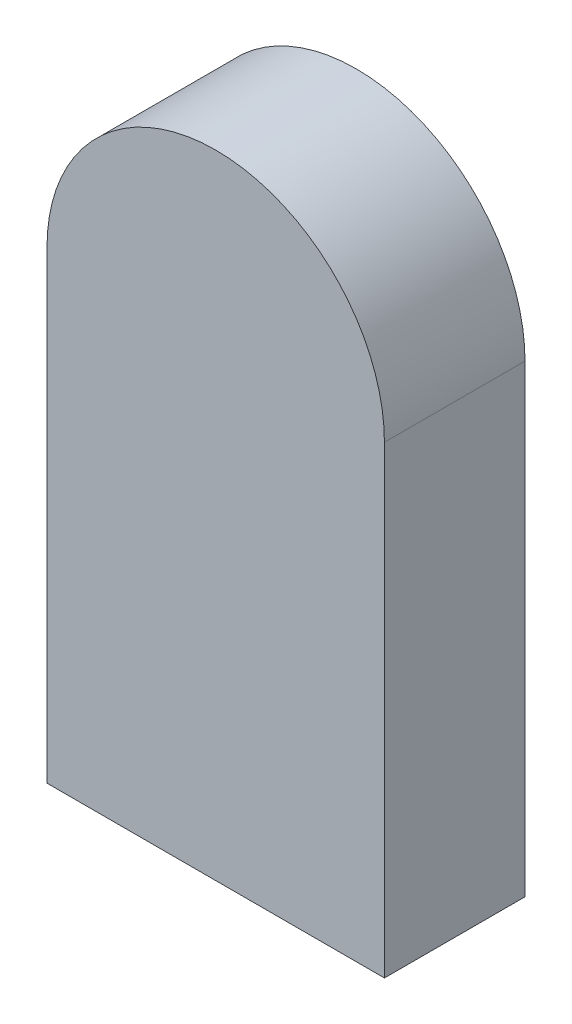
ISO-10303-21;
HEADER;
FILE_DESCRIPTION(('STEP AP214'),'2;1');
FILE_NAME('part.step','',(''),(''),'','','');
FILE_SCHEMA(('AUTOMOTIVE_DESIGN { 1 0 10303 214 1 1 1 1 }'));
ENDSEC;
DATA;
#1=APPLICATION_CONTEXT('core data for automotive mechanical design processes');
#2=APPLICATION_PROTOCOL_DEFINITION('international standard','automotive_design',2000,#1);
#3=PRODUCT_CONTEXT('',#1,'mechanical');
#4=PRODUCT('Part','Part','',(#3));
#5=PRODUCT_RELATED_PRODUCT_CATEGORY('part','',(#4));
#6=PRODUCT_DEFINITION_FORMATION('','',#4);
#7=PRODUCT_DEFINITION_CONTEXT('part definition',#1,'design');
#8=PRODUCT_DEFINITION('design','',#6,#7);
#9=PRODUCT_DEFINITION_SHAPE('','',#8);
#10=(LENGTH_UNIT() NAMED_UNIT(*) SI_UNIT(.MILLI.,.METRE.));
#11=(NAMED_UNIT(*) PLANE_ANGLE_UNIT() SI_UNIT($,.RADIAN.));
#12=(NAMED_UNIT(*) SI_UNIT($,.STERADIAN.) SOLID_ANGLE_UNIT());
#13=UNCERTAINTY_MEASURE_WITH_UNIT(LENGTH_MEASURE(1.E-05),#10,'distance_accuracy_value','');
#14=(GEOMETRIC_REPRESENTATION_CONTEXT(3) GLOBAL_UNCERTAINTY_ASSIGNED_CONTEXT((#13)) GLOBAL_UNIT_ASSIGNED_CONTEXT((#10,
#11,#12)) REPRESENTATION_CONTEXT('',''));
#15=CARTESIAN_POINT('',(0.,0.,0.));
#16=DIRECTION('',(0.,0.,1.));
#17=DIRECTION('',(1.,0.,0.));
#18=AXIS2_PLACEMENT_3D('',#15,#16,#17);
#19=CARTESIAN_POINT('',(1.63,-4.05,0.));
#20=DIRECTION('',(0.,1.,0.));
#21=DIRECTION('',(1.,0.,0.));
#22=AXIS2_PLACEMENT_3D('',#19,#20,#21);
#23=PLANE('',#22);
#24=DIRECTION('',(1.,0.,0.));
#25=VECTOR('',#24,1.);
#26=CARTESIAN_POINT('',(1.63,-4.05,0.));
#27=LINE('',#26,#25);
#28=CARTESIAN_POINT('',(1.63,-4.05,0.));
#29=VERTEX_POINT('',#28);
#30=CARTESIAN_POINT('',(1.87,-4.05,0.));
#31=VERTEX_POINT('',#30);
#32=EDGE_CURVE('E11',#29,#31,#27,.T.);
#33=ORIENTED_EDGE('',*,*,#32,.T.);
#34=DIRECTION('',(0.,0.,1.));
#35=VECTOR('',#34,1.);
#36=CARTESIAN_POINT('',(1.87,-4.05,0.));
#37=LINE('',#36,#35);
#38=CARTESIAN_POINT('',(1.87,-4.05,0.1));
#39=VERTEX_POINT('',#38);
#40=EDGE_CURVE('E24',#31,#39,#37,.T.);
#41=ORIENTED_EDGE('',*,*,#40,.T.);
#42=DIRECTION('',(1.,0.,0.));
#43=VECTOR('',#42,1.);
#44=CARTESIAN_POINT('',(1.63,-4.05,0.1));
#45=LINE('',#44,#43);
#46=CARTESIAN_POINT('',(1.63,-4.05,0.1));
#47=VERTEX_POINT('',#46);
#48=EDGE_CURVE('E87',#47,#39,#45,.T.);
#49=ORIENTED_EDGE('',*,*,#48,.F.);
#50=DIRECTION('',(0.,0.,1.));
#51=VECTOR('',#50,1.);
#52=CARTESIAN_POINT('',(1.63,-4.05,0.));
#53=LINE('',#52,#51);
#54=EDGE_CURVE('E36',#29,#47,#53,.T.);
#55=ORIENTED_EDGE('',*,*,#54,.F.);
#56=EDGE_LOOP('',(#33,#41,#49,#55));
#57=FACE_BOUND('',#56,.T.);
#58=ADVANCED_FACE('F17',(#57),#23,.F.);
#59=CARTESIAN_POINT('',(1.87,-4.05,0.));
#60=DIRECTION('',(-1.,0.,0.));
#61=DIRECTION('',(0.,1.,0.));
#62=AXIS2_PLACEMENT_3D('',#59,#60,#61);
#63=PLANE('',#62);
#64=DIRECTION('',(0.,1.,0.));
#65=VECTOR('',#64,1.);
#66=CARTESIAN_POINT('',(1.87,-4.05,0.));
#67=LINE('',#66,#65);
#68=CARTESIAN_POINT('',(1.87,-3.72,0.));
#69=VERTEX_POINT('',#68);
#70=EDGE_CURVE('E84',#31,#69,#67,.T.);
#71=ORIENTED_EDGE('',*,*,#70,.T.);
#72=DIRECTION('',(0.,0.,1.));
#73=VECTOR('',#72,1.);
#74=CARTESIAN_POINT('',(1.87,-3.72,0.));
#75=LINE('',#74,#73);
#76=CARTESIAN_POINT('',(1.87,-3.72,0.1));
#77=VERTEX_POINT('',#76);
#78=EDGE_CURVE('E82',#69,#77,#75,.T.);
#79=ORIENTED_EDGE('',*,*,#78,.T.);
#80=DIRECTION('',(0.,1.,0.));
#81=VECTOR('',#80,1.);
#82=CARTESIAN_POINT('',(1.87,-4.05,0.1));
#83=LINE('',#82,#81);
#84=EDGE_CURVE('E72',#39,#77,#83,.T.);
#85=ORIENTED_EDGE('',*,*,#84,.F.);
#86=ORIENTED_EDGE('',*,*,#40,.F.);
#87=EDGE_LOOP('',(#71,#79,#85,#86));
#88=FACE_BOUND('',#87,.T.);
#89=ADVANCED_FACE('F89',(#88),#63,.F.);
#90=CARTESIAN_POINT('',(1.75,-3.72,0.));
#91=DIRECTION('',(0.,0.,-1.));
#92=DIRECTION('',(1.,0.,0.));
#93=AXIS2_PLACEMENT_3D('',#90,#91,#92);
#94=CYLINDRICAL_SURFACE('',#93,0.12);
#95=CARTESIAN_POINT('',(1.75,-3.72,0.));
#96=DIRECTION('',(0.,0.,1.));
#97=DIRECTION('',(1.,0.,0.));
#98=AXIS2_PLACEMENT_3D('',#95,#96,#97);
#99=CIRCLE('',#98,0.12);
#100=CARTESIAN_POINT('',(1.63,-3.72,0.));
#101=VERTEX_POINT('',#100);
#102=EDGE_CURVE('E62',#69,#101,#99,.T.);
#103=ORIENTED_EDGE('',*,*,#102,.T.);
#104=DIRECTION('',(0.,0.,1.));
#105=VECTOR('',#104,1.);
#106=CARTESIAN_POINT('',(1.63,-3.72,0.));
#107=LINE('',#106,#105);
#108=CARTESIAN_POINT('',(1.63,-3.72,0.1));
#109=VERTEX_POINT('',#108);
#110=EDGE_CURVE('E57',#101,#109,#107,.T.);
#111=ORIENTED_EDGE('',*,*,#110,.T.);
#112=CARTESIAN_POINT('',(1.75,-3.72,0.1));
#113=DIRECTION('',(0.,0.,1.));
#114=DIRECTION('',(1.,0.,0.));
#115=AXIS2_PLACEMENT_3D('',#112,#113,#114);
#116=CIRCLE('',#115,0.12);
#117=EDGE_CURVE('E60',#77,#109,#116,.T.);
#118=ORIENTED_EDGE('',*,*,#117,.F.);
#119=ORIENTED_EDGE('',*,*,#78,.F.);
#120=EDGE_LOOP('',(#103,#111,#118,#119));
#121=FACE_BOUND('',#120,.T.);
#122=ADVANCED_FACE('F59',(#121),#94,.T.);
#123=CARTESIAN_POINT('',(1.63,-4.05,0.));
#124=DIRECTION('',(-1.,0.,0.));
#125=DIRECTION('',(0.,1.,0.));
#126=AXIS2_PLACEMENT_3D('',#123,#124,#125);
#127=PLANE('',#126);
#128=ORIENTED_EDGE('',*,*,#54,.T.);
#129=DIRECTION('',(0.,1.,0.));
#130=VECTOR('',#129,1.);
#131=CARTESIAN_POINT('',(1.63,-4.05,0.1));
#132=LINE('',#131,#130);
#133=EDGE_CURVE('E71',#47,#109,#132,.T.);
#134=ORIENTED_EDGE('',*,*,#133,.T.);
#135=ORIENTED_EDGE('',*,*,#110,.F.);
#136=DIRECTION('',(0.,1.,0.));
#137=VECTOR('',#136,1.);
#138=CARTESIAN_POINT('',(1.63,-4.05,0.));
#139=LINE('',#138,#137);
#140=EDGE_CURVE('E76',#29,#101,#139,.T.);
#141=ORIENTED_EDGE('',*,*,#140,.F.);
#142=EDGE_LOOP('',(#128,#134,#135,#141));
#143=FACE_BOUND('',#142,.T.);
#144=ADVANCED_FACE('F75',(#143),#127,.T.);
#145=CARTESIAN_POINT('',(1.75,-3.849490847913,0.));
#146=DIRECTION('',(0.,0.,1.));
#147=DIRECTION('',(1.,0.,0.));
#148=AXIS2_PLACEMENT_3D('',#145,#146,#147);
#149=PLANE('',#148);
#150=ORIENTED_EDGE('',*,*,#140,.T.);
#151=ORIENTED_EDGE('',*,*,#102,.F.);
#152=ORIENTED_EDGE('',*,*,#70,.F.);
#153=ORIENTED_EDGE('',*,*,#32,.F.);
#154=EDGE_LOOP('',(#150,#151,#152,#153));
#155=FACE_BOUND('',#154,.T.);
#156=ADVANCED_FACE('F91',(#155),#149,.F.);
#157=CARTESIAN_POINT('',(1.75,-3.849490847913,0.1));
#158=DIRECTION('',(0.,0.,1.));
#159=DIRECTION('',(1.,0.,0.));
#160=AXIS2_PLACEMENT_3D('',#157,#158,#159);
#161=PLANE('',#160);
#162=ORIENTED_EDGE('',*,*,#48,.T.);
#163=ORIENTED_EDGE('',*,*,#84,.T.);
#164=ORIENTED_EDGE('',*,*,#117,.T.);
#165=ORIENTED_EDGE('',*,*,#133,.F.);
#166=EDGE_LOOP('',(#162,#163,#164,#165));
#167=FACE_BOUND('',#166,.T.);
#168=ADVANCED_FACE('F70',(#167),#161,.T.);
#169=CLOSED_SHELL('',(#58,#89,#122,#144,#156,#168));
#170=MANIFOLD_SOLID_BREP('B1',#169);
#171=ADVANCED_BREP_SHAPE_REPRESENTATION('',(#18,#170),#14);
#172=SHAPE_DEFINITION_REPRESENTATION(#9,#171);
ENDSEC;
END-ISO-10303-21;
